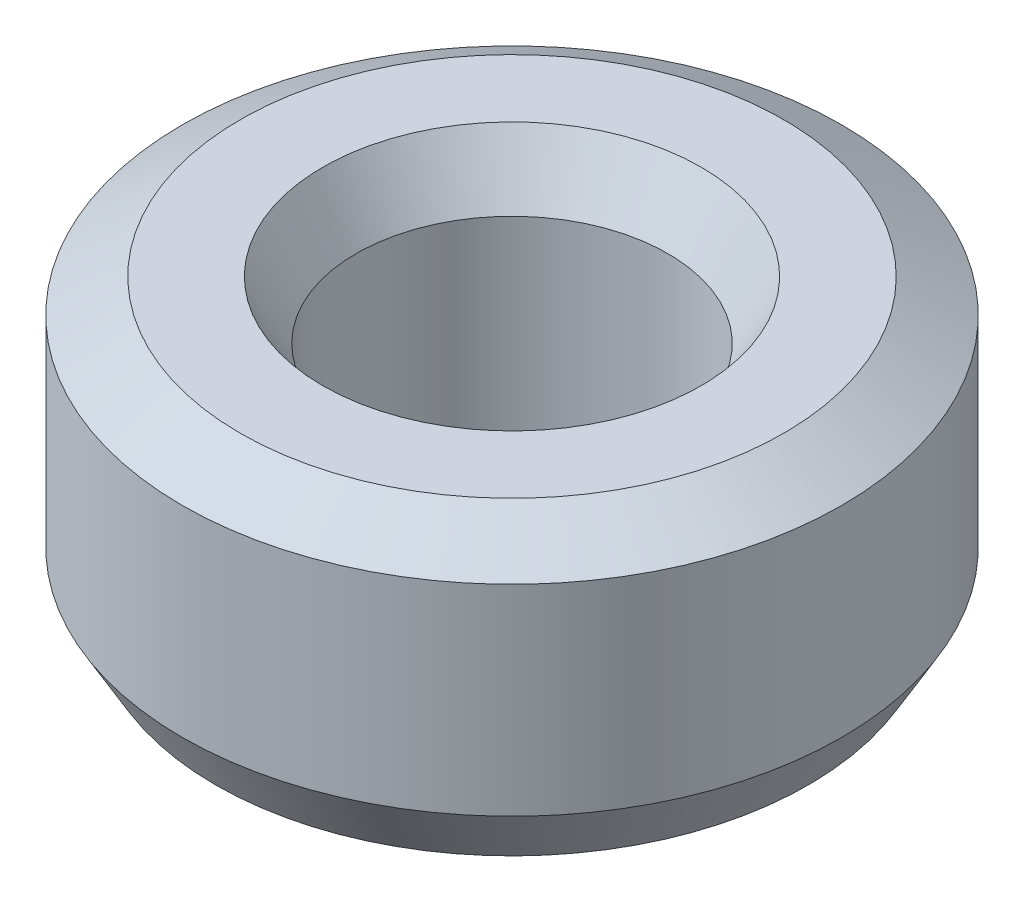
ISO-10303-21;
HEADER;
FILE_DESCRIPTION(('STEP AP214'),'2;1');
FILE_NAME('part.step','',(''),(''),'','','');
FILE_SCHEMA(('AUTOMOTIVE_DESIGN { 1 0 10303 214 1 1 1 1 }'));
ENDSEC;
DATA;
#1=APPLICATION_CONTEXT('core data for automotive mechanical design processes');
#2=APPLICATION_PROTOCOL_DEFINITION('international standard','automotive_design',2000,#1);
#3=PRODUCT_CONTEXT('',#1,'mechanical');
#4=PRODUCT('Part','Part','',(#3));
#5=PRODUCT_RELATED_PRODUCT_CATEGORY('part','',(#4));
#6=PRODUCT_DEFINITION_FORMATION('','',#4);
#7=PRODUCT_DEFINITION_CONTEXT('part definition',#1,'design');
#8=PRODUCT_DEFINITION('design','',#6,#7);
#9=PRODUCT_DEFINITION_SHAPE('','',#8);
#10=(LENGTH_UNIT() NAMED_UNIT(*) SI_UNIT(.MILLI.,.METRE.));
#11=(NAMED_UNIT(*) PLANE_ANGLE_UNIT() SI_UNIT($,.RADIAN.));
#12=(NAMED_UNIT(*) SI_UNIT($,.STERADIAN.) SOLID_ANGLE_UNIT());
#13=UNCERTAINTY_MEASURE_WITH_UNIT(LENGTH_MEASURE(1.E-05),#10,'distance_accuracy_value','');
#14=(GEOMETRIC_REPRESENTATION_CONTEXT(3) GLOBAL_UNCERTAINTY_ASSIGNED_CONTEXT((#13)) GLOBAL_UNIT_ASSIGNED_CONTEXT((#10,
#11,#12)) REPRESENTATION_CONTEXT('',''));
#15=CARTESIAN_POINT('',(0.,0.,0.));
#16=DIRECTION('',(0.,0.,1.));
#17=DIRECTION('',(1.,0.,0.));
#18=AXIS2_PLACEMENT_3D('',#15,#16,#17);
#19=CARTESIAN_POINT('',(0.,11.0855555620974,0.));
#20=DIRECTION('',(0.,-1.,0.));
#21=DIRECTION('',(0.,0.,-1.));
#22=AXIS2_PLACEMENT_3D('',#19,#20,#21);
#23=CYLINDRICAL_SURFACE('',#22,12.5);
#24=CARTESIAN_POINT('',(0.,2.19919471348947,0.));
#25=DIRECTION('',(0.,1.,0.));
#26=DIRECTION('',(0.,0.,1.));
#27=AXIS2_PLACEMENT_3D('',#24,#25,#26);
#28=CIRCLE('',#27,12.5);
#29=CARTESIAN_POINT('',(0.,2.19919471348947,12.5));
#30=VERTEX_POINT('',#29);
#31=EDGE_CURVE('E10',#30,#30,#28,.T.);
#32=ORIENTED_EDGE('',*,*,#31,.T.);
#33=EDGE_LOOP('',(#32));
#34=FACE_BOUND('',#33,.T.);
#35=CARTESIAN_POINT('',(0.,9.81584990226379,0.));
#36=DIRECTION('',(0.,1.,0.));
#37=DIRECTION('',(0.,0.,1.));
#38=AXIS2_PLACEMENT_3D('',#35,#36,#37);
#39=CIRCLE('',#38,12.5);
#40=CARTESIAN_POINT('',(0.,9.81584990226379,12.5));
#41=VERTEX_POINT('',#40);
#42=EDGE_CURVE('E50',#41,#41,#39,.F.);
#43=ORIENTED_EDGE('',*,*,#42,.T.);
#44=EDGE_LOOP('',(#43));
#45=FACE_BOUND('',#44,.T.);
#46=ADVANCED_FACE('F39',(#34,#45),#23,.T.);
#47=CARTESIAN_POINT('',(0.,11.0855555620974,0.));
#48=DIRECTION('',(0.,1.,0.));
#49=DIRECTION('',(0.,0.,1.));
#50=AXIS2_PLACEMENT_3D('',#47,#48,#49);
#51=PLANE('',#50);
#52=CARTESIAN_POINT('',(0.,11.0855555620974,0.));
#53=DIRECTION('',(0.,1.,0.));
#54=DIRECTION('',(0.,0.,1.));
#55=AXIS2_PLACEMENT_3D('',#52,#53,#54);
#56=CIRCLE('',#55,7.17574510910852);
#57=CARTESIAN_POINT('',(0.,11.0855555620974,7.17574510910852));
#58=VERTEX_POINT('',#57);
#59=EDGE_CURVE('E58',#58,#58,#56,.F.);
#60=ORIENTED_EDGE('',*,*,#59,.T.);
#61=EDGE_LOOP('',(#60));
#62=FACE_BOUND('',#61,.T.);
#63=CARTESIAN_POINT('',(0.,11.0855555620974,0.));
#64=DIRECTION('',(0.,1.,0.));
#65=DIRECTION('',(0.,0.,1.));
#66=AXIS2_PLACEMENT_3D('',#63,#64,#65);
#67=CIRCLE('',#66,10.3008052865105);
#68=CARTESIAN_POINT('',(0.,11.0855555620974,10.3008052865105));
#69=VERTEX_POINT('',#68);
#70=EDGE_CURVE('E61',#69,#69,#67,.T.);
#71=ORIENTED_EDGE('',*,*,#70,.T.);
#72=EDGE_LOOP('',(#71));
#73=FACE_BOUND('',#72,.T.);
#74=ADVANCED_FACE('F88',(#62,#73),#51,.T.);
#75=CARTESIAN_POINT('',(0.,0.,0.));
#76=DIRECTION('',(0.,1.,0.));
#77=DIRECTION('',(0.,0.,1.));
#78=AXIS2_PLACEMENT_3D('',#75,#76,#77);
#79=PLANE('',#78);
#80=CARTESIAN_POINT('',(0.,0.,0.));
#81=DIRECTION('',(0.,1.,0.));
#82=DIRECTION('',(0.,0.,1.));
#83=AXIS2_PLACEMENT_3D('',#80,#81,#82);
#84=CIRCLE('',#83,8.10523416276444);
#85=CARTESIAN_POINT('',(0.,0.,8.10523416276444));
#86=VERTEX_POINT('',#85);
#87=EDGE_CURVE('E51',#86,#86,#84,.T.);
#88=ORIENTED_EDGE('',*,*,#87,.T.);
#89=EDGE_LOOP('',(#88));
#90=FACE_BOUND('',#89,.T.);
#91=CARTESIAN_POINT('',(0.,0.,0.));
#92=DIRECTION('',(0.,1.,0.));
#93=DIRECTION('',(0.,0.,1.));
#94=AXIS2_PLACEMENT_3D('',#91,#92,#93);
#95=CIRCLE('',#94,11.2302943401664);
#96=CARTESIAN_POINT('',(0.,0.,11.2302943401664));
#97=VERTEX_POINT('',#96);
#98=EDGE_CURVE('E54',#97,#97,#95,.F.);
#99=ORIENTED_EDGE('',*,*,#98,.T.);
#100=EDGE_LOOP('',(#99));
#101=FACE_BOUND('',#100,.T.);
#102=ADVANCED_FACE('F83',(#90,#101),#79,.F.);
#103=CARTESIAN_POINT('',(0.,11.0855555620974,0.));
#104=DIRECTION('',(0.,-1.,0.));
#105=DIRECTION('',(0.,0.,-1.));
#106=AXIS2_PLACEMENT_3D('',#103,#104,#105);
#107=CYLINDRICAL_SURFACE('',#106,5.90603944927496);
#108=CARTESIAN_POINT('',(0.,8.88636084860787,0.));
#109=DIRECTION('',(0.,1.,0.));
#110=DIRECTION('',(0.,0.,1.));
#111=AXIS2_PLACEMENT_3D('',#108,#109,#110);
#112=CIRCLE('',#111,5.90603944927496);
#113=CARTESIAN_POINT('',(0.,8.88636084860787,5.90603944927496));
#114=VERTEX_POINT('',#113);
#115=EDGE_CURVE('E67',#114,#114,#112,.T.);
#116=ORIENTED_EDGE('',*,*,#115,.T.);
#117=EDGE_LOOP('',(#116));
#118=FACE_BOUND('',#117,.T.);
#119=CARTESIAN_POINT('',(0.,1.26970565983356,0.));
#120=DIRECTION('',(0.,1.,0.));
#121=DIRECTION('',(0.,0.,1.));
#122=AXIS2_PLACEMENT_3D('',#119,#120,#121);
#123=CIRCLE('',#122,5.90603944927496);
#124=CARTESIAN_POINT('',(0.,1.26970565983356,5.90603944927496));
#125=VERTEX_POINT('',#124);
#126=EDGE_CURVE('E69',#125,#125,#123,.F.);
#127=ORIENTED_EDGE('',*,*,#126,.T.);
#128=EDGE_LOOP('',(#127));
#129=FACE_BOUND('',#128,.T.);
#130=ADVANCED_FACE('F71',(#118,#129),#107,.F.);
#131=CARTESIAN_POINT('',(0.,8.88636084860787,0.));
#132=DIRECTION('',(0.,1.,0.));
#133=DIRECTION('',(0.,0.,1.));
#134=AXIS2_PLACEMENT_3D('',#131,#132,#133);
#135=CONICAL_SURFACE('',#134,5.90603944927496,0.523598775598303);
#136=ORIENTED_EDGE('',*,*,#59,.F.);
#137=EDGE_LOOP('',(#136));
#138=FACE_BOUND('',#137,.T.);
#139=ORIENTED_EDGE('',*,*,#115,.F.);
#140=EDGE_LOOP('',(#139));
#141=FACE_BOUND('',#140,.T.);
#142=ADVANCED_FACE('F77',(#138,#141),#135,.F.);
#143=CARTESIAN_POINT('',(0.,0.,0.));
#144=DIRECTION('',(0.,-1.,0.));
#145=DIRECTION('',(0.,0.,-1.));
#146=AXIS2_PLACEMENT_3D('',#143,#144,#145);
#147=CONICAL_SURFACE('',#146,8.10523416276444,1.04719755119659);
#148=ORIENTED_EDGE('',*,*,#126,.F.);
#149=EDGE_LOOP('',(#148));
#150=FACE_BOUND('',#149,.T.);
#151=ORIENTED_EDGE('',*,*,#87,.F.);
#152=EDGE_LOOP('',(#151));
#153=FACE_BOUND('',#152,.T.);
#154=ADVANCED_FACE('F73',(#150,#153),#147,.F.);
#155=CARTESIAN_POINT('',(0.,2.19919471348947,0.));
#156=DIRECTION('',(0.,1.,0.));
#157=DIRECTION('',(0.,0.,1.));
#158=AXIS2_PLACEMENT_3D('',#155,#156,#157);
#159=CONICAL_SURFACE('',#158,12.5,0.523598775598303);
#160=ORIENTED_EDGE('',*,*,#98,.F.);
#161=EDGE_LOOP('',(#160));
#162=FACE_BOUND('',#161,.T.);
#163=ORIENTED_EDGE('',*,*,#31,.F.);
#164=EDGE_LOOP('',(#163));
#165=FACE_BOUND('',#164,.T.);
#166=ADVANCED_FACE('F76',(#162,#165),#159,.T.);
#167=CARTESIAN_POINT('',(0.,11.0855555620974,0.));
#168=DIRECTION('',(0.,-1.,0.));
#169=DIRECTION('',(0.,0.,-1.));
#170=AXIS2_PLACEMENT_3D('',#167,#168,#169);
#171=CONICAL_SURFACE('',#170,10.3008052865105,1.04719755119659);
#172=ORIENTED_EDGE('',*,*,#42,.F.);
#173=EDGE_LOOP('',(#172));
#174=FACE_BOUND('',#173,.T.);
#175=ORIENTED_EDGE('',*,*,#70,.F.);
#176=EDGE_LOOP('',(#175));
#177=FACE_BOUND('',#176,.T.);
#178=ADVANCED_FACE('F45',(#174,#177),#171,.T.);
#179=CLOSED_SHELL('',(#46,#74,#102,#130,#142,#154,#166,#178));
#180=MANIFOLD_SOLID_BREP('B2',#179);
#181=ADVANCED_BREP_SHAPE_REPRESENTATION('',(#18,#180),#14);
#182=SHAPE_DEFINITION_REPRESENTATION(#9,#181);
ENDSEC;
END-ISO-10303-21;
